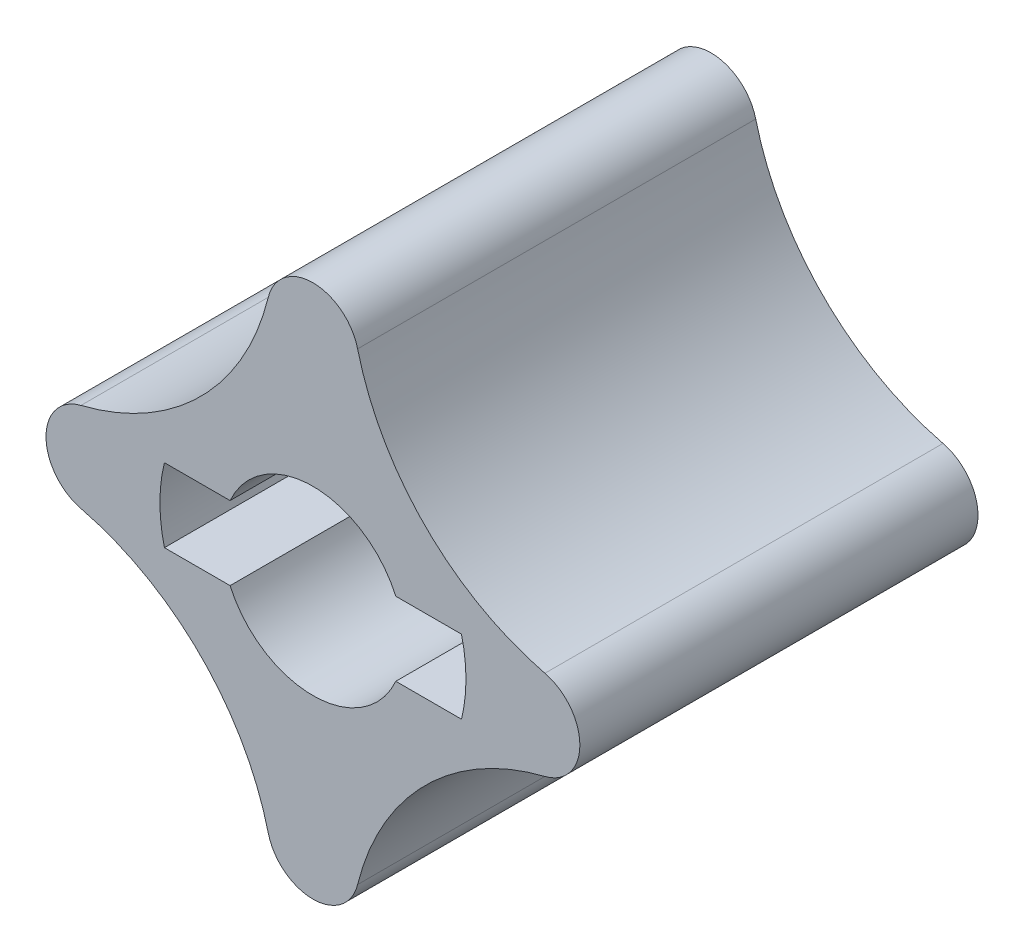
ISO-10303-21;
HEADER;
FILE_DESCRIPTION(('STEP AP214'),'2;1');
FILE_NAME('part.step','',(''),(''),'','','');
FILE_SCHEMA(('AUTOMOTIVE_DESIGN { 1 0 10303 214 1 1 1 1 }'));
ENDSEC;
DATA;
#1=APPLICATION_CONTEXT('core data for automotive mechanical design processes');
#2=APPLICATION_PROTOCOL_DEFINITION('international standard','automotive_design',2000,#1);
#3=PRODUCT_CONTEXT('',#1,'mechanical');
#4=PRODUCT('Part','Part','',(#3));
#5=PRODUCT_RELATED_PRODUCT_CATEGORY('part','',(#4));
#6=PRODUCT_DEFINITION_FORMATION('','',#4);
#7=PRODUCT_DEFINITION_CONTEXT('part definition',#1,'design');
#8=PRODUCT_DEFINITION('design','',#6,#7);
#9=PRODUCT_DEFINITION_SHAPE('','',#8);
#10=(LENGTH_UNIT() NAMED_UNIT(*) SI_UNIT(.MILLI.,.METRE.));
#11=(NAMED_UNIT(*) PLANE_ANGLE_UNIT() SI_UNIT($,.RADIAN.));
#12=(NAMED_UNIT(*) SI_UNIT($,.STERADIAN.) SOLID_ANGLE_UNIT());
#13=UNCERTAINTY_MEASURE_WITH_UNIT(LENGTH_MEASURE(1.E-05),#10,'distance_accuracy_value','');
#14=(GEOMETRIC_REPRESENTATION_CONTEXT(3) GLOBAL_UNCERTAINTY_ASSIGNED_CONTEXT((#13)) GLOBAL_UNIT_ASSIGNED_CONTEXT((#10,
#11,#12)) REPRESENTATION_CONTEXT('',''));
#15=CARTESIAN_POINT('',(0.,0.,0.));
#16=DIRECTION('',(0.,0.,1.));
#17=DIRECTION('',(1.,0.,0.));
#18=AXIS2_PLACEMENT_3D('',#15,#16,#17);
#19=CARTESIAN_POINT('',(14.1957353063081,8.09973530630812,21.971));
#20=DIRECTION('',(0.,0.,1.));
#21=DIRECTION('',(1.,0.,0.));
#22=AXIS2_PLACEMENT_3D('',#19,#20,#21);
#23=PLANE('',#22);
#24=CARTESIAN_POINT('',(16.1994706126162,16.1994706126162,21.971));
#25=DIRECTION('',(0.,0.,1.));
#26=DIRECTION('',(1.,0.,0.));
#27=AXIS2_PLACEMENT_3D('',#24,#25,#26);
#28=CIRCLE('',#27,14.1478);
#29=CARTESIAN_POINT('',(2.46567284819122,12.8019650856341,21.971));
#30=VERTEX_POINT('',#29);
#31=CARTESIAN_POINT('',(12.8019650856341,2.4656728481912,21.971));
#32=VERTEX_POINT('',#31);
#33=EDGE_CURVE('E218',#30,#32,#28,.T.);
#34=ORIENTED_EDGE('',*,*,#33,.F.);
#35=CARTESIAN_POINT('',(0.,12.192,21.971));
#36=DIRECTION('',(0.,0.,1.));
#37=DIRECTION('',(1.,0.,0.));
#38=AXIS2_PLACEMENT_3D('',#35,#36,#37);
#39=CIRCLE('',#38,2.54000000000001);
#40=CARTESIAN_POINT('',(-2.46567284819121,12.8019650856341,21.971));
#41=VERTEX_POINT('',#40);
#42=EDGE_CURVE('E234',#30,#41,#39,.T.);
#43=ORIENTED_EDGE('',*,*,#42,.T.);
#44=CARTESIAN_POINT('',(-16.1994706126162,16.1994706126162,21.971));
#45=DIRECTION('',(0.,0.,-1.));
#46=DIRECTION('',(-1.,0.,0.));
#47=AXIS2_PLACEMENT_3D('',#44,#45,#46);
#48=CIRCLE('',#47,14.1478);
#49=CARTESIAN_POINT('',(-12.8019650856341,2.46567284819121,21.971));
#50=VERTEX_POINT('',#49);
#51=EDGE_CURVE('E232',#41,#50,#48,.T.);
#52=ORIENTED_EDGE('',*,*,#51,.T.);
#53=CARTESIAN_POINT('',(-12.192,0.,21.971));
#54=DIRECTION('',(0.,0.,1.));
#55=DIRECTION('',(1.,0.,0.));
#56=AXIS2_PLACEMENT_3D('',#53,#54,#55);
#57=CIRCLE('',#56,2.54);
#58=CARTESIAN_POINT('',(-12.8019650856341,-2.4656728481912,21.971));
#59=VERTEX_POINT('',#58);
#60=EDGE_CURVE('E230',#50,#59,#57,.T.);
#61=ORIENTED_EDGE('',*,*,#60,.T.);
#62=CARTESIAN_POINT('',(-16.1994706126162,-16.1994706126162,21.971));
#63=DIRECTION('',(0.,0.,-1.));
#64=DIRECTION('',(-1.,0.,0.));
#65=AXIS2_PLACEMENT_3D('',#62,#63,#64);
#66=CIRCLE('',#65,14.1478);
#67=CARTESIAN_POINT('',(-2.46567284819121,-12.8019650856341,21.971));
#68=VERTEX_POINT('',#67);
#69=EDGE_CURVE('E228',#59,#68,#66,.T.);
#70=ORIENTED_EDGE('',*,*,#69,.T.);
#71=CARTESIAN_POINT('',(0.,-12.192,21.971));
#72=DIRECTION('',(0.,0.,1.));
#73=DIRECTION('',(1.,0.,0.));
#74=AXIS2_PLACEMENT_3D('',#71,#72,#73);
#75=CIRCLE('',#74,2.54);
#76=CARTESIAN_POINT('',(2.46567284819121,-12.8019650856341,21.971));
#77=VERTEX_POINT('',#76);
#78=EDGE_CURVE('E226',#68,#77,#75,.T.);
#79=ORIENTED_EDGE('',*,*,#78,.T.);
#80=CARTESIAN_POINT('',(16.1994706126162,-16.1994706126162,21.971));
#81=DIRECTION('',(0.,0.,1.));
#82=DIRECTION('',(1.,0.,0.));
#83=AXIS2_PLACEMENT_3D('',#80,#81,#82);
#84=CIRCLE('',#83,14.1478);
#85=CARTESIAN_POINT('',(12.8019650856341,-2.46567284819121,21.971));
#86=VERTEX_POINT('',#85);
#87=EDGE_CURVE('E223',#86,#77,#84,.T.);
#88=ORIENTED_EDGE('',*,*,#87,.F.);
#89=CARTESIAN_POINT('',(12.192,0.,21.971));
#90=DIRECTION('',(0.,0.,1.));
#91=DIRECTION('',(1.,0.,0.));
#92=AXIS2_PLACEMENT_3D('',#89,#90,#91);
#93=CIRCLE('',#92,2.54);
#94=EDGE_CURVE('E221',#86,#32,#93,.T.);
#95=ORIENTED_EDGE('',*,*,#94,.T.);
#96=EDGE_LOOP('',(#34,#43,#52,#61,#70,#79,#88,#95));
#97=FACE_BOUND('',#96,.T.);
#98=CARTESIAN_POINT('',(0.,0.,21.971));
#99=DIRECTION('',(0.,0.,1.));
#100=DIRECTION('',(1.,0.,0.));
#101=AXIS2_PLACEMENT_3D('',#98,#99,#100);
#102=CIRCLE('',#101,8.4455);
#103=CARTESIAN_POINT('',(-8.19740484848711,2.03200000000001,21.971));
#104=VERTEX_POINT('',#103);
#105=CARTESIAN_POINT('',(-8.19740484848711,-2.03199999999999,21.971));
#106=VERTEX_POINT('',#105);
#107=EDGE_CURVE('E159',#104,#106,#102,.T.);
#108=ORIENTED_EDGE('',*,*,#107,.F.);
#109=DIRECTION('',(1.,0.,0.));
#110=VECTOR('',#109,1.);
#111=CARTESIAN_POINT('',(-8.19740484848711,2.03200000000001,21.971));
#112=LINE('',#111,#110);
#113=CARTESIAN_POINT('',(-4.5726349559089,2.03200000000001,21.971));
#114=VERTEX_POINT('',#113);
#115=EDGE_CURVE('E177',#104,#114,#112,.T.);
#116=ORIENTED_EDGE('',*,*,#115,.T.);
#117=CARTESIAN_POINT('',(0.,0.,21.971));
#118=DIRECTION('',(0.,0.,1.));
#119=DIRECTION('',(1.,0.,0.));
#120=AXIS2_PLACEMENT_3D('',#117,#118,#119);
#121=CIRCLE('',#120,5.0038);
#122=CARTESIAN_POINT('',(4.57263495590891,2.03200000000001,21.971));
#123=VERTEX_POINT('',#122);
#124=EDGE_CURVE('E195',#123,#114,#121,.T.);
#125=ORIENTED_EDGE('',*,*,#124,.F.);
#126=CARTESIAN_POINT('',(8.19740484848712,2.03200000000001,21.971));
#127=VERTEX_POINT('',#126);
#128=EDGE_CURVE('E174',#123,#127,#112,.T.);
#129=ORIENTED_EDGE('',*,*,#128,.T.);
#130=CARTESIAN_POINT('',(0.,0.,21.971));
#131=DIRECTION('',(0.,0.,1.));
#132=DIRECTION('',(1.,0.,0.));
#133=AXIS2_PLACEMENT_3D('',#130,#131,#132);
#134=CIRCLE('',#133,8.4455);
#135=CARTESIAN_POINT('',(8.19740484848712,-2.03199999999999,21.971));
#136=VERTEX_POINT('',#135);
#137=EDGE_CURVE('E171',#136,#127,#134,.T.);
#138=ORIENTED_EDGE('',*,*,#137,.F.);
#139=DIRECTION('',(1.,0.,0.));
#140=VECTOR('',#139,1.);
#141=CARTESIAN_POINT('',(-8.19740484848711,-2.03199999999999,21.971));
#142=LINE('',#141,#140);
#143=CARTESIAN_POINT('',(4.57263495590891,-2.03199999999999,21.971));
#144=VERTEX_POINT('',#143);
#145=EDGE_CURVE('E165',#144,#136,#142,.T.);
#146=ORIENTED_EDGE('',*,*,#145,.F.);
#147=CARTESIAN_POINT('',(-4.5726349559089,-2.03199999999999,21.971));
#148=VERTEX_POINT('',#147);
#149=EDGE_CURVE('E170',#148,#144,#121,.T.);
#150=ORIENTED_EDGE('',*,*,#149,.F.);
#151=EDGE_CURVE('E151',#106,#148,#142,.T.);
#152=ORIENTED_EDGE('',*,*,#151,.F.);
#153=EDGE_LOOP('',(#108,#116,#125,#129,#138,#146,#150,#152));
#154=FACE_BOUND('',#153,.T.);
#155=ADVANCED_FACE('F35',(#97,#154),#23,.T.);
#156=CARTESIAN_POINT('',(0.,0.,21.971));
#157=DIRECTION('',(0.,0.,-1.));
#158=DIRECTION('',(-1.,0.,0.));
#159=AXIS2_PLACEMENT_3D('',#156,#157,#158);
#160=CYLINDRICAL_SURFACE('',#159,5.0038);
#161=CARTESIAN_POINT('',(0.,0.,0.));
#162=DIRECTION('',(0.,0.,1.));
#163=DIRECTION('',(1.,0.,0.));
#164=AXIS2_PLACEMENT_3D('',#161,#162,#163);
#165=CIRCLE('',#164,5.0038);
#166=CARTESIAN_POINT('',(5.0038,0.,0.));
#167=VERTEX_POINT('',#166);
#168=EDGE_CURVE('E188',#167,#167,#165,.T.);
#169=ORIENTED_EDGE('',*,*,#168,.F.);
#170=EDGE_LOOP('',(#169));
#171=FACE_BOUND('',#170,.T.);
#172=ORIENTED_EDGE('',*,*,#124,.T.);
#173=DIRECTION('',(0.,0.,-1.));
#174=VECTOR('',#173,1.);
#175=CARTESIAN_POINT('',(-4.5726349559089,2.03200000000001,21.971));
#176=LINE('',#175,#174);
#177=CARTESIAN_POINT('',(-4.5726349559089,2.03200000000001,6.858));
#178=VERTEX_POINT('',#177);
#179=EDGE_CURVE('E11',#114,#178,#176,.T.);
#180=ORIENTED_EDGE('',*,*,#179,.T.);
#181=CARTESIAN_POINT('',(0.,0.,6.858));
#182=DIRECTION('',(0.,0.,1.));
#183=DIRECTION('',(1.,0.,0.));
#184=AXIS2_PLACEMENT_3D('',#181,#182,#183);
#185=CIRCLE('',#184,5.0038);
#186=CARTESIAN_POINT('',(-4.5726349559089,-2.03199999999999,6.858));
#187=VERTEX_POINT('',#186);
#188=EDGE_CURVE('E260',#178,#187,#185,.T.);
#189=ORIENTED_EDGE('',*,*,#188,.T.);
#190=DIRECTION('',(0.,0.,-1.));
#191=VECTOR('',#190,1.);
#192=CARTESIAN_POINT('',(-4.5726349559089,-2.03199999999999,21.971));
#193=LINE('',#192,#191);
#194=EDGE_CURVE('E43',#148,#187,#193,.T.);
#195=ORIENTED_EDGE('',*,*,#194,.F.);
#196=ORIENTED_EDGE('',*,*,#149,.T.);
#197=DIRECTION('',(0.,0.,-1.));
#198=VECTOR('',#197,1.);
#199=CARTESIAN_POINT('',(4.5726349559089,-2.03199999999999,21.971));
#200=LINE('',#199,#198);
#201=CARTESIAN_POINT('',(4.57263495590891,-2.03199999999999,6.858));
#202=VERTEX_POINT('',#201);
#203=EDGE_CURVE('E259',#202,#144,#200,.F.);
#204=ORIENTED_EDGE('',*,*,#203,.F.);
#205=CARTESIAN_POINT('',(4.57263495590891,2.03200000000001,6.858));
#206=VERTEX_POINT('',#205);
#207=EDGE_CURVE('E239',#202,#206,#185,.T.);
#208=ORIENTED_EDGE('',*,*,#207,.T.);
#209=DIRECTION('',(0.,0.,-1.));
#210=VECTOR('',#209,1.);
#211=CARTESIAN_POINT('',(4.5726349559089,2.03200000000001,21.971));
#212=LINE('',#211,#210);
#213=EDGE_CURVE('E262',#206,#123,#212,.F.);
#214=ORIENTED_EDGE('',*,*,#213,.T.);
#215=EDGE_LOOP('',(#172,#180,#189,#195,#196,#204,#208,#214));
#216=FACE_BOUND('',#215,.T.);
#217=ADVANCED_FACE('F266',(#171,#216),#160,.F.);
#218=CARTESIAN_POINT('',(14.1957353063081,8.09973530630812,0.));
#219=DIRECTION('',(0.,0.,1.));
#220=DIRECTION('',(1.,0.,0.));
#221=AXIS2_PLACEMENT_3D('',#218,#219,#220);
#222=PLANE('',#221);
#223=CARTESIAN_POINT('',(16.1994706126162,16.1994706126162,0.));
#224=DIRECTION('',(0.,0.,1.));
#225=DIRECTION('',(1.,0.,0.));
#226=AXIS2_PLACEMENT_3D('',#223,#224,#225);
#227=CIRCLE('',#226,14.1478);
#228=CARTESIAN_POINT('',(2.46567284819122,12.8019650856341,0.));
#229=VERTEX_POINT('',#228);
#230=CARTESIAN_POINT('',(12.8019650856341,2.4656728481912,0.));
#231=VERTEX_POINT('',#230);
#232=EDGE_CURVE('E198',#229,#231,#227,.T.);
#233=ORIENTED_EDGE('',*,*,#232,.T.);
#234=CARTESIAN_POINT('',(12.192,0.,0.));
#235=DIRECTION('',(0.,0.,1.));
#236=DIRECTION('',(1.,0.,0.));
#237=AXIS2_PLACEMENT_3D('',#234,#235,#236);
#238=CIRCLE('',#237,2.54);
#239=CARTESIAN_POINT('',(12.8019650856341,-2.46567284819121,0.));
#240=VERTEX_POINT('',#239);
#241=EDGE_CURVE('E201',#240,#231,#238,.T.);
#242=ORIENTED_EDGE('',*,*,#241,.F.);
#243=CARTESIAN_POINT('',(16.1994706126162,-16.1994706126162,0.));
#244=DIRECTION('',(0.,0.,1.));
#245=DIRECTION('',(1.,0.,0.));
#246=AXIS2_PLACEMENT_3D('',#243,#244,#245);
#247=CIRCLE('',#246,14.1478);
#248=CARTESIAN_POINT('',(2.46567284819121,-12.8019650856341,0.));
#249=VERTEX_POINT('',#248);
#250=EDGE_CURVE('E204',#240,#249,#247,.T.);
#251=ORIENTED_EDGE('',*,*,#250,.T.);
#252=CARTESIAN_POINT('',(0.,-12.192,0.));
#253=DIRECTION('',(0.,0.,1.));
#254=DIRECTION('',(1.,0.,0.));
#255=AXIS2_PLACEMENT_3D('',#252,#253,#254);
#256=CIRCLE('',#255,2.54);
#257=CARTESIAN_POINT('',(-2.46567284819121,-12.8019650856341,0.));
#258=VERTEX_POINT('',#257);
#259=EDGE_CURVE('E207',#258,#249,#256,.T.);
#260=ORIENTED_EDGE('',*,*,#259,.F.);
#261=CARTESIAN_POINT('',(-16.1994706126162,-16.1994706126162,0.));
#262=DIRECTION('',(0.,0.,-1.));
#263=DIRECTION('',(-1.,0.,0.));
#264=AXIS2_PLACEMENT_3D('',#261,#262,#263);
#265=CIRCLE('',#264,14.1478);
#266=CARTESIAN_POINT('',(-12.8019650856341,-2.4656728481912,0.));
#267=VERTEX_POINT('',#266);
#268=EDGE_CURVE('E210',#267,#258,#265,.T.);
#269=ORIENTED_EDGE('',*,*,#268,.F.);
#270=CARTESIAN_POINT('',(-12.192,0.,0.));
#271=DIRECTION('',(0.,0.,1.));
#272=DIRECTION('',(1.,0.,0.));
#273=AXIS2_PLACEMENT_3D('',#270,#271,#272);
#274=CIRCLE('',#273,2.54);
#275=CARTESIAN_POINT('',(-12.8019650856341,2.46567284819121,0.));
#276=VERTEX_POINT('',#275);
#277=EDGE_CURVE('E212',#276,#267,#274,.T.);
#278=ORIENTED_EDGE('',*,*,#277,.F.);
#279=CARTESIAN_POINT('',(-16.1994706126162,16.1994706126162,0.));
#280=DIRECTION('',(0.,0.,-1.));
#281=DIRECTION('',(-1.,0.,0.));
#282=AXIS2_PLACEMENT_3D('',#279,#280,#281);
#283=CIRCLE('',#282,14.1478);
#284=CARTESIAN_POINT('',(-2.46567284819121,12.8019650856341,0.));
#285=VERTEX_POINT('',#284);
#286=EDGE_CURVE('E214',#285,#276,#283,.T.);
#287=ORIENTED_EDGE('',*,*,#286,.F.);
#288=CARTESIAN_POINT('',(0.,12.192,0.));
#289=DIRECTION('',(0.,0.,1.));
#290=DIRECTION('',(1.,0.,0.));
#291=AXIS2_PLACEMENT_3D('',#288,#289,#290);
#292=CIRCLE('',#291,2.54000000000001);
#293=EDGE_CURVE('E216',#229,#285,#292,.T.);
#294=ORIENTED_EDGE('',*,*,#293,.F.);
#295=EDGE_LOOP('',(#233,#242,#251,#260,#269,#278,#287,#294));
#296=FACE_BOUND('',#295,.T.);
#297=ORIENTED_EDGE('',*,*,#168,.T.);
#298=EDGE_LOOP('',(#297));
#299=FACE_BOUND('',#298,.T.);
#300=ADVANCED_FACE('F304',(#296,#299),#222,.F.);
#301=CARTESIAN_POINT('',(16.1994706126162,16.1994706126162,21.971));
#302=DIRECTION('',(0.,0.,-1.));
#303=DIRECTION('',(-1.,0.,0.));
#304=AXIS2_PLACEMENT_3D('',#301,#302,#303);
#305=CYLINDRICAL_SURFACE('',#304,14.1478);
#306=ORIENTED_EDGE('',*,*,#232,.F.);
#307=DIRECTION('',(0.,0.,-1.));
#308=VECTOR('',#307,1.);
#309=CARTESIAN_POINT('',(2.46567284819122,12.8019650856341,21.971));
#310=LINE('',#309,#308);
#311=EDGE_CURVE('E237',#30,#229,#310,.T.);
#312=ORIENTED_EDGE('',*,*,#311,.F.);
#313=ORIENTED_EDGE('',*,*,#33,.T.);
#314=DIRECTION('',(0.,0.,-1.));
#315=VECTOR('',#314,1.);
#316=CARTESIAN_POINT('',(12.8019650856341,2.4656728481912,21.971));
#317=LINE('',#316,#315);
#318=EDGE_CURVE('E236',#32,#231,#317,.T.);
#319=ORIENTED_EDGE('',*,*,#318,.T.);
#320=EDGE_LOOP('',(#306,#312,#313,#319));
#321=FACE_BOUND('',#320,.T.);
#322=ADVANCED_FACE('F37',(#321),#305,.F.);
#323=CARTESIAN_POINT('',(0.,12.192,21.971));
#324=DIRECTION('',(0.,0.,-1.));
#325=DIRECTION('',(-1.,0.,0.));
#326=AXIS2_PLACEMENT_3D('',#323,#324,#325);
#327=CYLINDRICAL_SURFACE('',#326,2.54000000000001);
#328=ORIENTED_EDGE('',*,*,#293,.T.);
#329=DIRECTION('',(0.,0.,-1.));
#330=VECTOR('',#329,1.);
#331=CARTESIAN_POINT('',(-2.46567284819121,12.8019650856341,21.971));
#332=LINE('',#331,#330);
#333=EDGE_CURVE('E240',#41,#285,#332,.T.);
#334=ORIENTED_EDGE('',*,*,#333,.F.);
#335=ORIENTED_EDGE('',*,*,#42,.F.);
#336=ORIENTED_EDGE('',*,*,#311,.T.);
#337=EDGE_LOOP('',(#328,#334,#335,#336));
#338=FACE_BOUND('',#337,.T.);
#339=ADVANCED_FACE('F310',(#338),#327,.T.);
#340=CARTESIAN_POINT('',(-16.1994706126162,16.1994706126162,21.971));
#341=DIRECTION('',(0.,0.,-1.));
#342=DIRECTION('',(-1.,0.,0.));
#343=AXIS2_PLACEMENT_3D('',#340,#341,#342);
#344=CYLINDRICAL_SURFACE('',#343,14.1478);
#345=ORIENTED_EDGE('',*,*,#286,.T.);
#346=DIRECTION('',(0.,0.,-1.));
#347=VECTOR('',#346,1.);
#348=CARTESIAN_POINT('',(-12.8019650856341,2.46567284819121,21.971));
#349=LINE('',#348,#347);
#350=EDGE_CURVE('E243',#50,#276,#349,.T.);
#351=ORIENTED_EDGE('',*,*,#350,.F.);
#352=ORIENTED_EDGE('',*,*,#51,.F.);
#353=ORIENTED_EDGE('',*,*,#333,.T.);
#354=EDGE_LOOP('',(#345,#351,#352,#353));
#355=FACE_BOUND('',#354,.T.);
#356=ADVANCED_FACE('F313',(#355),#344,.F.);
#357=CARTESIAN_POINT('',(-12.192,0.,21.971));
#358=DIRECTION('',(0.,0.,-1.));
#359=DIRECTION('',(-1.,0.,0.));
#360=AXIS2_PLACEMENT_3D('',#357,#358,#359);
#361=CYLINDRICAL_SURFACE('',#360,2.54);
#362=ORIENTED_EDGE('',*,*,#277,.T.);
#363=DIRECTION('',(0.,0.,-1.));
#364=VECTOR('',#363,1.);
#365=CARTESIAN_POINT('',(-12.8019650856341,-2.4656728481912,21.971));
#366=LINE('',#365,#364);
#367=EDGE_CURVE('E246',#59,#267,#366,.T.);
#368=ORIENTED_EDGE('',*,*,#367,.F.);
#369=ORIENTED_EDGE('',*,*,#60,.F.);
#370=ORIENTED_EDGE('',*,*,#350,.T.);
#371=EDGE_LOOP('',(#362,#368,#369,#370));
#372=FACE_BOUND('',#371,.T.);
#373=ADVANCED_FACE('F317',(#372),#361,.T.);
#374=CARTESIAN_POINT('',(-16.1994706126162,-16.1994706126162,21.971));
#375=DIRECTION('',(0.,0.,-1.));
#376=DIRECTION('',(-1.,0.,0.));
#377=AXIS2_PLACEMENT_3D('',#374,#375,#376);
#378=CYLINDRICAL_SURFACE('',#377,14.1478);
#379=ORIENTED_EDGE('',*,*,#268,.T.);
#380=DIRECTION('',(0.,0.,-1.));
#381=VECTOR('',#380,1.);
#382=CARTESIAN_POINT('',(-2.46567284819121,-12.8019650856341,21.971));
#383=LINE('',#382,#381);
#384=EDGE_CURVE('E249',#68,#258,#383,.T.);
#385=ORIENTED_EDGE('',*,*,#384,.F.);
#386=ORIENTED_EDGE('',*,*,#69,.F.);
#387=ORIENTED_EDGE('',*,*,#367,.T.);
#388=EDGE_LOOP('',(#379,#385,#386,#387));
#389=FACE_BOUND('',#388,.T.);
#390=ADVANCED_FACE('F321',(#389),#378,.F.);
#391=CARTESIAN_POINT('',(0.,-12.192,21.971));
#392=DIRECTION('',(0.,0.,-1.));
#393=DIRECTION('',(-1.,0.,0.));
#394=AXIS2_PLACEMENT_3D('',#391,#392,#393);
#395=CYLINDRICAL_SURFACE('',#394,2.54);
#396=ORIENTED_EDGE('',*,*,#259,.T.);
#397=DIRECTION('',(0.,0.,-1.));
#398=VECTOR('',#397,1.);
#399=CARTESIAN_POINT('',(2.46567284819121,-12.8019650856341,21.971));
#400=LINE('',#399,#398);
#401=EDGE_CURVE('E252',#77,#249,#400,.T.);
#402=ORIENTED_EDGE('',*,*,#401,.F.);
#403=ORIENTED_EDGE('',*,*,#78,.F.);
#404=ORIENTED_EDGE('',*,*,#384,.T.);
#405=EDGE_LOOP('',(#396,#402,#403,#404));
#406=FACE_BOUND('',#405,.T.);
#407=ADVANCED_FACE('F325',(#406),#395,.T.);
#408=CARTESIAN_POINT('',(16.1994706126162,-16.1994706126162,21.971));
#409=DIRECTION('',(0.,0.,-1.));
#410=DIRECTION('',(-1.,0.,0.));
#411=AXIS2_PLACEMENT_3D('',#408,#409,#410);
#412=CYLINDRICAL_SURFACE('',#411,14.1478);
#413=ORIENTED_EDGE('',*,*,#250,.F.);
#414=DIRECTION('',(0.,0.,-1.));
#415=VECTOR('',#414,1.);
#416=CARTESIAN_POINT('',(12.8019650856341,-2.46567284819121,21.971));
#417=LINE('',#416,#415);
#418=EDGE_CURVE('E254',#86,#240,#417,.T.);
#419=ORIENTED_EDGE('',*,*,#418,.F.);
#420=ORIENTED_EDGE('',*,*,#87,.T.);
#421=ORIENTED_EDGE('',*,*,#401,.T.);
#422=EDGE_LOOP('',(#413,#419,#420,#421));
#423=FACE_BOUND('',#422,.T.);
#424=ADVANCED_FACE('F294',(#423),#412,.F.);
#425=CARTESIAN_POINT('',(12.192,0.,21.971));
#426=DIRECTION('',(0.,0.,-1.));
#427=DIRECTION('',(-1.,0.,0.));
#428=AXIS2_PLACEMENT_3D('',#425,#426,#427);
#429=CYLINDRICAL_SURFACE('',#428,2.54);
#430=ORIENTED_EDGE('',*,*,#241,.T.);
#431=ORIENTED_EDGE('',*,*,#318,.F.);
#432=ORIENTED_EDGE('',*,*,#94,.F.);
#433=ORIENTED_EDGE('',*,*,#418,.T.);
#434=EDGE_LOOP('',(#430,#431,#432,#433));
#435=FACE_BOUND('',#434,.T.);
#436=ADVANCED_FACE('F287',(#435),#429,.T.);
#437=CARTESIAN_POINT('',(0.,0.,6.858));
#438=DIRECTION('',(0.,0.,1.));
#439=DIRECTION('',(1.,0.,0.));
#440=AXIS2_PLACEMENT_3D('',#437,#438,#439);
#441=PLANE('',#440);
#442=DIRECTION('',(1.,0.,0.));
#443=VECTOR('',#442,1.);
#444=CARTESIAN_POINT('',(-8.19740484848711,-2.03199999999999,6.858));
#445=LINE('',#444,#443);
#446=CARTESIAN_POINT('',(8.19740484848712,-2.03199999999999,6.858));
#447=VERTEX_POINT('',#446);
#448=EDGE_CURVE('E181',#202,#447,#445,.T.);
#449=ORIENTED_EDGE('',*,*,#448,.T.);
#450=CARTESIAN_POINT('',(0.,0.,6.858));
#451=DIRECTION('',(0.,0.,1.));
#452=DIRECTION('',(1.,0.,0.));
#453=AXIS2_PLACEMENT_3D('',#450,#451,#452);
#454=CIRCLE('',#453,8.4455);
#455=CARTESIAN_POINT('',(8.19740484848712,2.03200000000001,6.858));
#456=VERTEX_POINT('',#455);
#457=EDGE_CURVE('E183',#447,#456,#454,.T.);
#458=ORIENTED_EDGE('',*,*,#457,.T.);
#459=DIRECTION('',(1.,0.,0.));
#460=VECTOR('',#459,1.);
#461=CARTESIAN_POINT('',(-8.19740484848711,2.03200000000001,6.858));
#462=LINE('',#461,#460);
#463=EDGE_CURVE('E58',#206,#456,#462,.T.);
#464=ORIENTED_EDGE('',*,*,#463,.F.);
#465=ORIENTED_EDGE('',*,*,#207,.F.);
#466=EDGE_LOOP('',(#449,#458,#464,#465));
#467=FACE_BOUND('',#466,.T.);
#468=ADVANCED_FACE('F285',(#467),#441,.T.);
#469=CARTESIAN_POINT('',(-8.19740484848711,-2.03199999999999,6.858));
#470=DIRECTION('',(0.,-1.,0.));
#471=DIRECTION('',(0.,0.,-1.));
#472=AXIS2_PLACEMENT_3D('',#469,#470,#471);
#473=PLANE('',#472);
#474=ORIENTED_EDGE('',*,*,#203,.T.);
#475=ORIENTED_EDGE('',*,*,#145,.T.);
#476=DIRECTION('',(0.,0.,1.));
#477=VECTOR('',#476,1.);
#478=CARTESIAN_POINT('',(8.19740484848712,-2.03199999999999,6.858));
#479=LINE('',#478,#477);
#480=EDGE_CURVE('E155',#447,#136,#479,.T.);
#481=ORIENTED_EDGE('',*,*,#480,.F.);
#482=ORIENTED_EDGE('',*,*,#448,.F.);
#483=EDGE_LOOP('',(#474,#475,#481,#482));
#484=FACE_BOUND('',#483,.T.);
#485=ADVANCED_FACE('F284',(#484),#473,.F.);
#486=CARTESIAN_POINT('',(-8.19740484848711,2.03200000000001,6.858));
#487=DIRECTION('',(0.,-1.,0.));
#488=DIRECTION('',(0.,0.,-1.));
#489=AXIS2_PLACEMENT_3D('',#486,#487,#488);
#490=PLANE('',#489);
#491=ORIENTED_EDGE('',*,*,#463,.T.);
#492=DIRECTION('',(0.,0.,1.));
#493=VECTOR('',#492,1.);
#494=CARTESIAN_POINT('',(8.19740484848712,2.03200000000001,6.858));
#495=LINE('',#494,#493);
#496=EDGE_CURVE('E189',#456,#127,#495,.T.);
#497=ORIENTED_EDGE('',*,*,#496,.T.);
#498=ORIENTED_EDGE('',*,*,#128,.F.);
#499=ORIENTED_EDGE('',*,*,#213,.F.);
#500=EDGE_LOOP('',(#491,#497,#498,#499));
#501=FACE_BOUND('',#500,.T.);
#502=ADVANCED_FACE('F275',(#501),#490,.T.);
#503=CARTESIAN_POINT('',(0.,0.,6.858));
#504=DIRECTION('',(0.,0.,1.));
#505=DIRECTION('',(1.,0.,0.));
#506=AXIS2_PLACEMENT_3D('',#503,#504,#505);
#507=CYLINDRICAL_SURFACE('',#506,8.4455);
#508=ORIENTED_EDGE('',*,*,#137,.T.);
#509=ORIENTED_EDGE('',*,*,#496,.F.);
#510=ORIENTED_EDGE('',*,*,#457,.F.);
#511=ORIENTED_EDGE('',*,*,#480,.T.);
#512=EDGE_LOOP('',(#508,#509,#510,#511));
#513=FACE_BOUND('',#512,.T.);
#514=ADVANCED_FACE('F279',(#513),#507,.F.);
#515=ORIENTED_EDGE('',*,*,#115,.F.);
#516=DIRECTION('',(0.,0.,1.));
#517=VECTOR('',#516,1.);
#518=CARTESIAN_POINT('',(-8.19740484848711,2.03200000000001,6.858));
#519=LINE('',#518,#517);
#520=CARTESIAN_POINT('',(-8.19740484848711,2.03200000000001,6.858));
#521=VERTEX_POINT('',#520);
#522=EDGE_CURVE('E161',#521,#104,#519,.T.);
#523=ORIENTED_EDGE('',*,*,#522,.F.);
#524=EDGE_CURVE('E156',#521,#178,#462,.T.);
#525=ORIENTED_EDGE('',*,*,#524,.T.);
#526=ORIENTED_EDGE('',*,*,#179,.F.);
#527=EDGE_LOOP('',(#515,#523,#525,#526));
#528=FACE_BOUND('',#527,.T.);
#529=ADVANCED_FACE('F270',(#528),#490,.T.);
#530=ORIENTED_EDGE('',*,*,#194,.T.);
#531=CARTESIAN_POINT('',(-8.19740484848711,-2.03199999999999,6.858));
#532=VERTEX_POINT('',#531);
#533=EDGE_CURVE('E50',#532,#187,#445,.T.);
#534=ORIENTED_EDGE('',*,*,#533,.F.);
#535=DIRECTION('',(0.,0.,1.));
#536=VECTOR('',#535,1.);
#537=CARTESIAN_POINT('',(-8.19740484848711,-2.03199999999999,6.858));
#538=LINE('',#537,#536);
#539=EDGE_CURVE('E147',#532,#106,#538,.T.);
#540=ORIENTED_EDGE('',*,*,#539,.T.);
#541=ORIENTED_EDGE('',*,*,#151,.T.);
#542=EDGE_LOOP('',(#530,#534,#540,#541));
#543=FACE_BOUND('',#542,.T.);
#544=ADVANCED_FACE('F149',(#543),#473,.F.);
#545=ORIENTED_EDGE('',*,*,#524,.F.);
#546=CARTESIAN_POINT('',(0.,0.,6.858));
#547=DIRECTION('',(0.,0.,1.));
#548=DIRECTION('',(1.,0.,0.));
#549=AXIS2_PLACEMENT_3D('',#546,#547,#548);
#550=CIRCLE('',#549,8.4455);
#551=EDGE_CURVE('E179',#521,#532,#550,.T.);
#552=ORIENTED_EDGE('',*,*,#551,.T.);
#553=ORIENTED_EDGE('',*,*,#533,.T.);
#554=ORIENTED_EDGE('',*,*,#188,.F.);
#555=EDGE_LOOP('',(#545,#552,#553,#554));
#556=FACE_BOUND('',#555,.T.);
#557=ADVANCED_FACE('F268',(#556),#441,.T.);
#558=CARTESIAN_POINT('',(0.,0.,6.858));
#559=DIRECTION('',(0.,0.,1.));
#560=DIRECTION('',(1.,0.,0.));
#561=AXIS2_PLACEMENT_3D('',#558,#559,#560);
#562=CYLINDRICAL_SURFACE('',#561,8.4455);
#563=ORIENTED_EDGE('',*,*,#107,.T.);
#564=ORIENTED_EDGE('',*,*,#539,.F.);
#565=ORIENTED_EDGE('',*,*,#551,.F.);
#566=ORIENTED_EDGE('',*,*,#522,.T.);
#567=EDGE_LOOP('',(#563,#564,#565,#566));
#568=FACE_BOUND('',#567,.T.);
#569=ADVANCED_FACE('F160',(#568),#562,.F.);
#570=CLOSED_SHELL('',(#155,#217,#300,#322,#339,#356,#373,#390,#407,#424,#436,#468,#485,#502,
#514,#529,#544,#557,#569));
#571=MANIFOLD_SOLID_BREP('B2',#570);
#572=ADVANCED_BREP_SHAPE_REPRESENTATION('',(#18,#571),#14);
#573=SHAPE_DEFINITION_REPRESENTATION(#9,#572);
ENDSEC;
END-ISO-10303-21;
